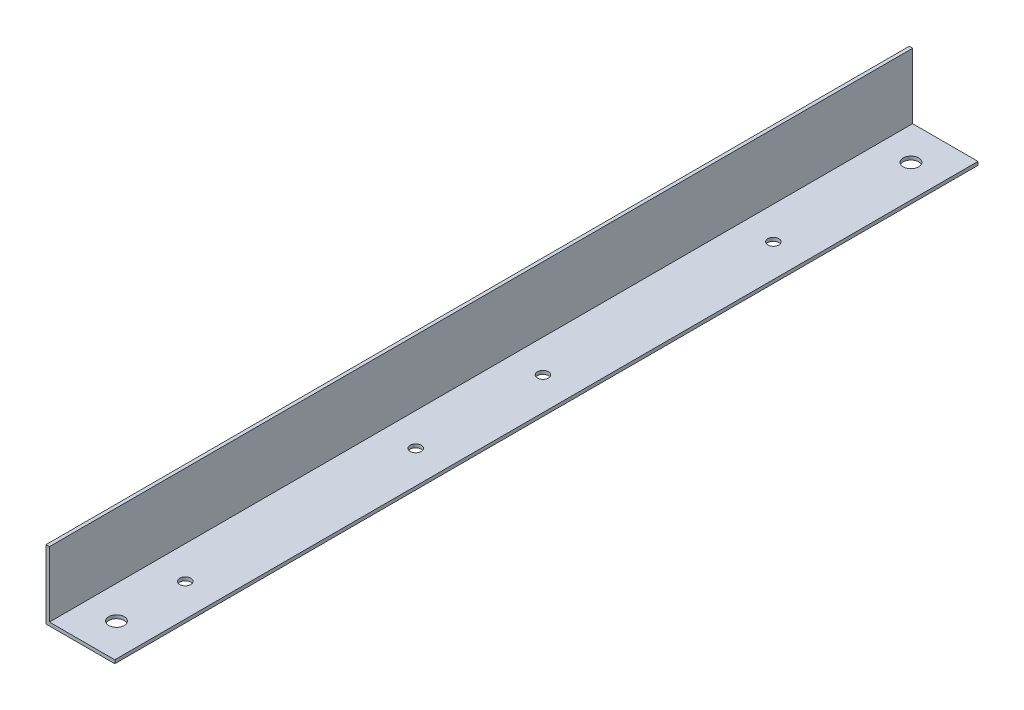
ISO-10303-21;
HEADER;
FILE_DESCRIPTION(('STEP AP214'),'2;1');
FILE_NAME('part.step','',(''),(''),'','','');
FILE_SCHEMA(('AUTOMOTIVE_DESIGN { 1 0 10303 214 1 1 1 1 }'));
ENDSEC;
DATA;
#1=APPLICATION_CONTEXT('core data for automotive mechanical design processes');
#2=APPLICATION_PROTOCOL_DEFINITION('international standard','automotive_design',2000,#1);
#3=PRODUCT_CONTEXT('',#1,'mechanical');
#4=PRODUCT('Part','Part','',(#3));
#5=PRODUCT_RELATED_PRODUCT_CATEGORY('part','',(#4));
#6=PRODUCT_DEFINITION_FORMATION('','',#4);
#7=PRODUCT_DEFINITION_CONTEXT('part definition',#1,'design');
#8=PRODUCT_DEFINITION('design','',#6,#7);
#9=PRODUCT_DEFINITION_SHAPE('','',#8);
#10=(LENGTH_UNIT() NAMED_UNIT(*) SI_UNIT(.MILLI.,.METRE.));
#11=(NAMED_UNIT(*) PLANE_ANGLE_UNIT() SI_UNIT($,.RADIAN.));
#12=(NAMED_UNIT(*) SI_UNIT($,.STERADIAN.) SOLID_ANGLE_UNIT());
#13=UNCERTAINTY_MEASURE_WITH_UNIT(LENGTH_MEASURE(1.E-05),#10,'distance_accuracy_value','');
#14=(GEOMETRIC_REPRESENTATION_CONTEXT(3) GLOBAL_UNCERTAINTY_ASSIGNED_CONTEXT((#13)) GLOBAL_UNIT_ASSIGNED_CONTEXT((#10,
#11,#12)) REPRESENTATION_CONTEXT('',''));
#15=CARTESIAN_POINT('',(0.,0.,0.));
#16=DIRECTION('',(0.,0.,1.));
#17=DIRECTION('',(1.,0.,0.));
#18=AXIS2_PLACEMENT_3D('',#15,#16,#17);
#19=CARTESIAN_POINT('',(20.,0.,251.));
#20=DIRECTION('',(0.,1.,0.));
#21=DIRECTION('',(-1.,0.,0.));
#22=AXIS2_PLACEMENT_3D('',#19,#20,#21);
#23=PLANE('',#22);
#24=CARTESIAN_POINT('',(10.5,0.,10.));
#25=DIRECTION('',(0.,1.,0.));
#26=DIRECTION('',(0.,0.,1.));
#27=AXIS2_PLACEMENT_3D('',#24,#25,#26);
#28=CIRCLE('',#27,2.25);
#29=CARTESIAN_POINT('',(10.5,0.,12.25));
#30=VERTEX_POINT('',#29);
#31=EDGE_CURVE('E166',#30,#30,#28,.T.);
#32=ORIENTED_EDGE('',*,*,#31,.T.);
#33=EDGE_LOOP('',(#32));
#34=FACE_BOUND('',#33,.T.);
#35=CARTESIAN_POINT('',(10.5,0.,241.));
#36=DIRECTION('',(0.,1.,0.));
#37=DIRECTION('',(0.,0.,1.));
#38=AXIS2_PLACEMENT_3D('',#35,#36,#37);
#39=CIRCLE('',#38,2.25);
#40=CARTESIAN_POINT('',(10.5,0.,243.25));
#41=VERTEX_POINT('',#40);
#42=EDGE_CURVE('E170',#41,#41,#39,.T.);
#43=ORIENTED_EDGE('',*,*,#42,.T.);
#44=EDGE_LOOP('',(#43));
#45=FACE_BOUND('',#44,.T.);
#46=CARTESIAN_POINT('',(10.5,0.,154.));
#47=DIRECTION('',(0.,1.,0.));
#48=DIRECTION('',(0.,0.,1.));
#49=AXIS2_PLACEMENT_3D('',#46,#47,#48);
#50=CIRCLE('',#49,1.6);
#51=CARTESIAN_POINT('',(10.5,0.,155.6));
#52=VERTEX_POINT('',#51);
#53=EDGE_CURVE('E174',#52,#52,#50,.T.);
#54=ORIENTED_EDGE('',*,*,#53,.T.);
#55=EDGE_LOOP('',(#54));
#56=FACE_BOUND('',#55,.T.);
#57=CARTESIAN_POINT('',(10.5,0.,221.));
#58=DIRECTION('',(0.,1.,0.));
#59=DIRECTION('',(0.,0.,1.));
#60=AXIS2_PLACEMENT_3D('',#57,#58,#59);
#61=CIRCLE('',#60,1.59999999999999);
#62=CARTESIAN_POINT('',(10.5,0.,222.6));
#63=VERTEX_POINT('',#62);
#64=EDGE_CURVE('E178',#63,#63,#61,.T.);
#65=ORIENTED_EDGE('',*,*,#64,.T.);
#66=EDGE_LOOP('',(#65));
#67=FACE_BOUND('',#66,.T.);
#68=CARTESIAN_POINT('',(10.5,0.,117.));
#69=DIRECTION('',(0.,1.,0.));
#70=DIRECTION('',(0.,0.,1.));
#71=AXIS2_PLACEMENT_3D('',#68,#69,#70);
#72=CIRCLE('',#71,1.6);
#73=CARTESIAN_POINT('',(10.5,0.,118.6));
#74=VERTEX_POINT('',#73);
#75=EDGE_CURVE('E182',#74,#74,#72,.T.);
#76=ORIENTED_EDGE('',*,*,#75,.T.);
#77=EDGE_LOOP('',(#76));
#78=FACE_BOUND('',#77,.T.);
#79=CARTESIAN_POINT('',(10.5,0.,50.));
#80=DIRECTION('',(0.,1.,0.));
#81=DIRECTION('',(0.,0.,1.));
#82=AXIS2_PLACEMENT_3D('',#79,#80,#81);
#83=CIRCLE('',#82,1.6);
#84=CARTESIAN_POINT('',(10.5,0.,51.6));
#85=VERTEX_POINT('',#84);
#86=EDGE_CURVE('E125',#85,#85,#83,.T.);
#87=ORIENTED_EDGE('',*,*,#86,.T.);
#88=EDGE_LOOP('',(#87));
#89=FACE_BOUND('',#88,.T.);
#90=DIRECTION('',(1.,0.,0.));
#91=VECTOR('',#90,1.);
#92=CARTESIAN_POINT('',(20.,0.,0.));
#93=LINE('',#92,#91);
#94=CARTESIAN_POINT('',(0.,0.,0.));
#95=VERTEX_POINT('',#94);
#96=CARTESIAN_POINT('',(20.,0.,0.));
#97=VERTEX_POINT('',#96);
#98=EDGE_CURVE('E121',#95,#97,#93,.T.);
#99=ORIENTED_EDGE('',*,*,#98,.T.);
#100=DIRECTION('',(0.,0.,-1.));
#101=VECTOR('',#100,1.);
#102=CARTESIAN_POINT('',(20.,0.,251.));
#103=LINE('',#102,#101);
#104=CARTESIAN_POINT('',(20.,0.,251.));
#105=VERTEX_POINT('',#104);
#106=EDGE_CURVE('E11',#105,#97,#103,.T.);
#107=ORIENTED_EDGE('',*,*,#106,.F.);
#108=DIRECTION('',(1.,0.,0.));
#109=VECTOR('',#108,1.);
#110=CARTESIAN_POINT('',(20.,0.,251.));
#111=LINE('',#110,#109);
#112=CARTESIAN_POINT('',(0.,0.,251.));
#113=VERTEX_POINT('',#112);
#114=EDGE_CURVE('E132',#113,#105,#111,.T.);
#115=ORIENTED_EDGE('',*,*,#114,.F.);
#116=DIRECTION('',(0.,0.,-1.));
#117=VECTOR('',#116,1.);
#118=CARTESIAN_POINT('',(0.,0.,251.));
#119=LINE('',#118,#117);
#120=EDGE_CURVE('E117',#113,#95,#119,.T.);
#121=ORIENTED_EDGE('',*,*,#120,.T.);
#122=EDGE_LOOP('',(#99,#107,#115,#121));
#123=FACE_BOUND('',#122,.T.);
#124=ADVANCED_FACE('F37',(#34,#45,#56,#67,#78,#89,#123),#23,.F.);
#125=CARTESIAN_POINT('',(20.,1.,251.));
#126=DIRECTION('',(-1.,0.,0.));
#127=DIRECTION('',(0.,0.,1.));
#128=AXIS2_PLACEMENT_3D('',#125,#126,#127);
#129=PLANE('',#128);
#130=DIRECTION('',(0.,1.,0.));
#131=VECTOR('',#130,1.);
#132=CARTESIAN_POINT('',(20.,1.,0.));
#133=LINE('',#132,#131);
#134=CARTESIAN_POINT('',(20.,1.,0.));
#135=VERTEX_POINT('',#134);
#136=EDGE_CURVE('E124',#97,#135,#133,.T.);
#137=ORIENTED_EDGE('',*,*,#136,.T.);
#138=DIRECTION('',(0.,0.,-1.));
#139=VECTOR('',#138,1.);
#140=CARTESIAN_POINT('',(20.,1.,251.));
#141=LINE('',#140,#139);
#142=CARTESIAN_POINT('',(20.,1.,251.));
#143=VERTEX_POINT('',#142);
#144=EDGE_CURVE('E45',#143,#135,#141,.T.);
#145=ORIENTED_EDGE('',*,*,#144,.F.);
#146=DIRECTION('',(0.,1.,0.));
#147=VECTOR('',#146,1.);
#148=CARTESIAN_POINT('',(20.,1.,251.));
#149=LINE('',#148,#147);
#150=EDGE_CURVE('E90',#105,#143,#149,.T.);
#151=ORIENTED_EDGE('',*,*,#150,.F.);
#152=ORIENTED_EDGE('',*,*,#106,.T.);
#153=EDGE_LOOP('',(#137,#145,#151,#152));
#154=FACE_BOUND('',#153,.T.);
#155=ADVANCED_FACE('F156',(#154),#129,.F.);
#156=CARTESIAN_POINT('',(1.,1.,251.));
#157=DIRECTION('',(0.,-1.,0.));
#158=DIRECTION('',(0.,0.,-1.));
#159=AXIS2_PLACEMENT_3D('',#156,#157,#158);
#160=PLANE('',#159);
#161=CARTESIAN_POINT('',(10.5,1.,10.));
#162=DIRECTION('',(0.,1.,0.));
#163=DIRECTION('',(0.,0.,1.));
#164=AXIS2_PLACEMENT_3D('',#161,#162,#163);
#165=CIRCLE('',#164,2.25);
#166=CARTESIAN_POINT('',(10.5,1.,12.25));
#167=VERTEX_POINT('',#166);
#168=EDGE_CURVE('E209',#167,#167,#165,.T.);
#169=ORIENTED_EDGE('',*,*,#168,.F.);
#170=EDGE_LOOP('',(#169));
#171=FACE_BOUND('',#170,.T.);
#172=CARTESIAN_POINT('',(10.5,1.,241.));
#173=DIRECTION('',(0.,1.,0.));
#174=DIRECTION('',(0.,0.,1.));
#175=AXIS2_PLACEMENT_3D('',#172,#173,#174);
#176=CIRCLE('',#175,2.25);
#177=CARTESIAN_POINT('',(10.5,1.,243.25));
#178=VERTEX_POINT('',#177);
#179=EDGE_CURVE('E205',#178,#178,#176,.T.);
#180=ORIENTED_EDGE('',*,*,#179,.F.);
#181=EDGE_LOOP('',(#180));
#182=FACE_BOUND('',#181,.T.);
#183=CARTESIAN_POINT('',(10.5,1.,154.));
#184=DIRECTION('',(0.,1.,0.));
#185=DIRECTION('',(0.,0.,1.));
#186=AXIS2_PLACEMENT_3D('',#183,#184,#185);
#187=CIRCLE('',#186,1.6);
#188=CARTESIAN_POINT('',(10.5,1.,155.6));
#189=VERTEX_POINT('',#188);
#190=EDGE_CURVE('E201',#189,#189,#187,.T.);
#191=ORIENTED_EDGE('',*,*,#190,.F.);
#192=EDGE_LOOP('',(#191));
#193=FACE_BOUND('',#192,.T.);
#194=CARTESIAN_POINT('',(10.5,1.,221.));
#195=DIRECTION('',(0.,1.,0.));
#196=DIRECTION('',(0.,0.,1.));
#197=AXIS2_PLACEMENT_3D('',#194,#195,#196);
#198=CIRCLE('',#197,1.59999999999999);
#199=CARTESIAN_POINT('',(10.5,1.,222.6));
#200=VERTEX_POINT('',#199);
#201=EDGE_CURVE('E197',#200,#200,#198,.T.);
#202=ORIENTED_EDGE('',*,*,#201,.F.);
#203=EDGE_LOOP('',(#202));
#204=FACE_BOUND('',#203,.T.);
#205=CARTESIAN_POINT('',(10.5,1.,117.));
#206=DIRECTION('',(0.,1.,0.));
#207=DIRECTION('',(0.,0.,1.));
#208=AXIS2_PLACEMENT_3D('',#205,#206,#207);
#209=CIRCLE('',#208,1.6);
#210=CARTESIAN_POINT('',(10.5,1.,118.6));
#211=VERTEX_POINT('',#210);
#212=EDGE_CURVE('E191',#211,#211,#209,.T.);
#213=ORIENTED_EDGE('',*,*,#212,.F.);
#214=EDGE_LOOP('',(#213));
#215=FACE_BOUND('',#214,.T.);
#216=CARTESIAN_POINT('',(10.5,1.,50.));
#217=DIRECTION('',(0.,1.,0.));
#218=DIRECTION('',(0.,0.,1.));
#219=AXIS2_PLACEMENT_3D('',#216,#217,#218);
#220=CIRCLE('',#219,1.6);
#221=CARTESIAN_POINT('',(10.5,1.,51.6));
#222=VERTEX_POINT('',#221);
#223=EDGE_CURVE('E186',#222,#222,#220,.T.);
#224=ORIENTED_EDGE('',*,*,#223,.F.);
#225=EDGE_LOOP('',(#224));
#226=FACE_BOUND('',#225,.T.);
#227=DIRECTION('',(-1.,0.,0.));
#228=VECTOR('',#227,1.);
#229=CARTESIAN_POINT('',(1.,1.,0.));
#230=LINE('',#229,#228);
#231=CARTESIAN_POINT('',(1.,1.,0.));
#232=VERTEX_POINT('',#231);
#233=EDGE_CURVE('E127',#135,#232,#230,.T.);
#234=ORIENTED_EDGE('',*,*,#233,.T.);
#235=DIRECTION('',(0.,0.,-1.));
#236=VECTOR('',#235,1.);
#237=CARTESIAN_POINT('',(1.,1.,251.));
#238=LINE('',#237,#236);
#239=CARTESIAN_POINT('',(1.,1.,251.));
#240=VERTEX_POINT('',#239);
#241=EDGE_CURVE('E112',#240,#232,#238,.T.);
#242=ORIENTED_EDGE('',*,*,#241,.F.);
#243=DIRECTION('',(-1.,0.,0.));
#244=VECTOR('',#243,1.);
#245=CARTESIAN_POINT('',(1.,1.,251.));
#246=LINE('',#245,#244);
#247=EDGE_CURVE('E103',#143,#240,#246,.T.);
#248=ORIENTED_EDGE('',*,*,#247,.F.);
#249=ORIENTED_EDGE('',*,*,#144,.T.);
#250=EDGE_LOOP('',(#234,#242,#248,#249));
#251=FACE_BOUND('',#250,.T.);
#252=ADVANCED_FACE('F138',(#171,#182,#193,#204,#215,#226,#251),#160,.F.);
#253=CARTESIAN_POINT('',(1.,20.,251.));
#254=DIRECTION('',(-1.,0.,0.));
#255=DIRECTION('',(0.,-1.,0.));
#256=AXIS2_PLACEMENT_3D('',#253,#254,#255);
#257=PLANE('',#256);
#258=DIRECTION('',(0.,1.,0.));
#259=VECTOR('',#258,1.);
#260=CARTESIAN_POINT('',(1.,20.,0.));
#261=LINE('',#260,#259);
#262=CARTESIAN_POINT('',(1.,20.,0.));
#263=VERTEX_POINT('',#262);
#264=EDGE_CURVE('E111',#232,#263,#261,.T.);
#265=ORIENTED_EDGE('',*,*,#264,.T.);
#266=DIRECTION('',(0.,0.,-1.));
#267=VECTOR('',#266,1.);
#268=CARTESIAN_POINT('',(1.,20.,251.));
#269=LINE('',#268,#267);
#270=CARTESIAN_POINT('',(1.,20.,251.));
#271=VERTEX_POINT('',#270);
#272=EDGE_CURVE('E108',#271,#263,#269,.T.);
#273=ORIENTED_EDGE('',*,*,#272,.F.);
#274=DIRECTION('',(0.,1.,0.));
#275=VECTOR('',#274,1.);
#276=CARTESIAN_POINT('',(1.,20.,251.));
#277=LINE('',#276,#275);
#278=EDGE_CURVE('E97',#240,#271,#277,.T.);
#279=ORIENTED_EDGE('',*,*,#278,.F.);
#280=ORIENTED_EDGE('',*,*,#241,.T.);
#281=EDGE_LOOP('',(#265,#273,#279,#280));
#282=FACE_BOUND('',#281,.T.);
#283=ADVANCED_FACE('F109',(#282),#257,.F.);
#284=CARTESIAN_POINT('',(0.,20.,251.));
#285=DIRECTION('',(0.,-1.,0.));
#286=DIRECTION('',(0.,0.,-1.));
#287=AXIS2_PLACEMENT_3D('',#284,#285,#286);
#288=PLANE('',#287);
#289=DIRECTION('',(-1.,0.,0.));
#290=VECTOR('',#289,1.);
#291=CARTESIAN_POINT('',(0.,20.,0.));
#292=LINE('',#291,#290);
#293=CARTESIAN_POINT('',(0.,20.,0.));
#294=VERTEX_POINT('',#293);
#295=EDGE_CURVE('E76',#263,#294,#292,.T.);
#296=ORIENTED_EDGE('',*,*,#295,.T.);
#297=DIRECTION('',(0.,0.,-1.));
#298=VECTOR('',#297,1.);
#299=CARTESIAN_POINT('',(0.,20.,251.));
#300=LINE('',#299,#298);
#301=CARTESIAN_POINT('',(0.,20.,251.));
#302=VERTEX_POINT('',#301);
#303=EDGE_CURVE('E113',#302,#294,#300,.T.);
#304=ORIENTED_EDGE('',*,*,#303,.F.);
#305=DIRECTION('',(-1.,0.,0.));
#306=VECTOR('',#305,1.);
#307=CARTESIAN_POINT('',(0.,20.,251.));
#308=LINE('',#307,#306);
#309=EDGE_CURVE('E101',#271,#302,#308,.T.);
#310=ORIENTED_EDGE('',*,*,#309,.F.);
#311=ORIENTED_EDGE('',*,*,#272,.T.);
#312=EDGE_LOOP('',(#296,#304,#310,#311));
#313=FACE_BOUND('',#312,.T.);
#314=ADVANCED_FACE('F115',(#313),#288,.F.);
#315=CARTESIAN_POINT('',(0.,0.,251.));
#316=DIRECTION('',(1.,0.,0.));
#317=DIRECTION('',(0.,0.,-1.));
#318=AXIS2_PLACEMENT_3D('',#315,#316,#317);
#319=PLANE('',#318);
#320=DIRECTION('',(0.,-1.,0.));
#321=VECTOR('',#320,1.);
#322=CARTESIAN_POINT('',(0.,0.,0.));
#323=LINE('',#322,#321);
#324=EDGE_CURVE('E82',#294,#95,#323,.T.);
#325=ORIENTED_EDGE('',*,*,#324,.T.);
#326=ORIENTED_EDGE('',*,*,#120,.F.);
#327=DIRECTION('',(0.,-1.,0.));
#328=VECTOR('',#327,1.);
#329=CARTESIAN_POINT('',(0.,0.,251.));
#330=LINE('',#329,#328);
#331=EDGE_CURVE('E53',#302,#113,#330,.T.);
#332=ORIENTED_EDGE('',*,*,#331,.F.);
#333=ORIENTED_EDGE('',*,*,#303,.T.);
#334=EDGE_LOOP('',(#325,#326,#332,#333));
#335=FACE_BOUND('',#334,.T.);
#336=ADVANCED_FACE('F145',(#335),#319,.F.);
#337=CARTESIAN_POINT('',(0.,0.,251.));
#338=DIRECTION('',(0.,0.,-1.));
#339=DIRECTION('',(-1.,0.,0.));
#340=AXIS2_PLACEMENT_3D('',#337,#338,#339);
#341=PLANE('',#340);
#342=ORIENTED_EDGE('',*,*,#114,.T.);
#343=ORIENTED_EDGE('',*,*,#150,.T.);
#344=ORIENTED_EDGE('',*,*,#247,.T.);
#345=ORIENTED_EDGE('',*,*,#278,.T.);
#346=ORIENTED_EDGE('',*,*,#309,.T.);
#347=ORIENTED_EDGE('',*,*,#331,.T.);
#348=EDGE_LOOP('',(#342,#343,#344,#345,#346,#347));
#349=FACE_BOUND('',#348,.T.);
#350=ADVANCED_FACE('F99',(#349),#341,.F.);
#351=CARTESIAN_POINT('',(0.,0.,0.));
#352=DIRECTION('',(0.,0.,-1.));
#353=DIRECTION('',(-1.,0.,0.));
#354=AXIS2_PLACEMENT_3D('',#351,#352,#353);
#355=PLANE('',#354);
#356=ORIENTED_EDGE('',*,*,#98,.F.);
#357=ORIENTED_EDGE('',*,*,#324,.F.);
#358=ORIENTED_EDGE('',*,*,#295,.F.);
#359=ORIENTED_EDGE('',*,*,#264,.F.);
#360=ORIENTED_EDGE('',*,*,#233,.F.);
#361=ORIENTED_EDGE('',*,*,#136,.F.);
#362=EDGE_LOOP('',(#356,#357,#358,#359,#360,#361));
#363=FACE_BOUND('',#362,.T.);
#364=ADVANCED_FACE('F141',(#363),#355,.T.);
#365=CARTESIAN_POINT('',(10.5,0.,50.));
#366=DIRECTION('',(0.,1.,0.));
#367=DIRECTION('',(0.,0.,1.));
#368=AXIS2_PLACEMENT_3D('',#365,#366,#367);
#369=CYLINDRICAL_SURFACE('',#368,1.6);
#370=ORIENTED_EDGE('',*,*,#86,.F.);
#371=EDGE_LOOP('',(#370));
#372=FACE_BOUND('',#371,.T.);
#373=ORIENTED_EDGE('',*,*,#223,.T.);
#374=EDGE_LOOP('',(#373));
#375=FACE_BOUND('',#374,.T.);
#376=ADVANCED_FACE('F228',(#372,#375),#369,.F.);
#377=CARTESIAN_POINT('',(10.5,0.,117.));
#378=DIRECTION('',(0.,1.,0.));
#379=DIRECTION('',(0.,0.,1.));
#380=AXIS2_PLACEMENT_3D('',#377,#378,#379);
#381=CYLINDRICAL_SURFACE('',#380,1.6);
#382=ORIENTED_EDGE('',*,*,#75,.F.);
#383=EDGE_LOOP('',(#382));
#384=FACE_BOUND('',#383,.T.);
#385=ORIENTED_EDGE('',*,*,#212,.T.);
#386=EDGE_LOOP('',(#385));
#387=FACE_BOUND('',#386,.T.);
#388=ADVANCED_FACE('F230',(#384,#387),#381,.F.);
#389=CARTESIAN_POINT('',(10.5,0.,221.));
#390=DIRECTION('',(0.,1.,0.));
#391=DIRECTION('',(0.,0.,1.));
#392=AXIS2_PLACEMENT_3D('',#389,#390,#391);
#393=CYLINDRICAL_SURFACE('',#392,1.59999999999999);
#394=ORIENTED_EDGE('',*,*,#64,.F.);
#395=EDGE_LOOP('',(#394));
#396=FACE_BOUND('',#395,.T.);
#397=ORIENTED_EDGE('',*,*,#201,.T.);
#398=EDGE_LOOP('',(#397));
#399=FACE_BOUND('',#398,.T.);
#400=ADVANCED_FACE('F236',(#396,#399),#393,.F.);
#401=CARTESIAN_POINT('',(10.5,0.,154.));
#402=DIRECTION('',(0.,1.,0.));
#403=DIRECTION('',(0.,0.,1.));
#404=AXIS2_PLACEMENT_3D('',#401,#402,#403);
#405=CYLINDRICAL_SURFACE('',#404,1.6);
#406=ORIENTED_EDGE('',*,*,#53,.F.);
#407=EDGE_LOOP('',(#406));
#408=FACE_BOUND('',#407,.T.);
#409=ORIENTED_EDGE('',*,*,#190,.T.);
#410=EDGE_LOOP('',(#409));
#411=FACE_BOUND('',#410,.T.);
#412=ADVANCED_FACE('F242',(#408,#411),#405,.F.);
#413=CARTESIAN_POINT('',(10.5,0.,241.));
#414=DIRECTION('',(0.,1.,0.));
#415=DIRECTION('',(0.,0.,1.));
#416=AXIS2_PLACEMENT_3D('',#413,#414,#415);
#417=CYLINDRICAL_SURFACE('',#416,2.25);
#418=ORIENTED_EDGE('',*,*,#42,.F.);
#419=EDGE_LOOP('',(#418));
#420=FACE_BOUND('',#419,.T.);
#421=ORIENTED_EDGE('',*,*,#179,.T.);
#422=EDGE_LOOP('',(#421));
#423=FACE_BOUND('',#422,.T.);
#424=ADVANCED_FACE('F246',(#420,#423),#417,.F.);
#425=CARTESIAN_POINT('',(10.5,0.,10.));
#426=DIRECTION('',(0.,1.,0.));
#427=DIRECTION('',(0.,0.,1.));
#428=AXIS2_PLACEMENT_3D('',#425,#426,#427);
#429=CYLINDRICAL_SURFACE('',#428,2.25);
#430=ORIENTED_EDGE('',*,*,#31,.F.);
#431=EDGE_LOOP('',(#430));
#432=FACE_BOUND('',#431,.T.);
#433=ORIENTED_EDGE('',*,*,#168,.T.);
#434=EDGE_LOOP('',(#433));
#435=FACE_BOUND('',#434,.T.);
#436=ADVANCED_FACE('F214',(#432,#435),#429,.F.);
#437=CLOSED_SHELL('',(#124,#155,#252,#283,#314,#336,#350,#364,#376,#388,#400,#412,#424,#436));
#438=MANIFOLD_SOLID_BREP('B2',#437);
#439=ADVANCED_BREP_SHAPE_REPRESENTATION('',(#18,#438),#14);
#440=SHAPE_DEFINITION_REPRESENTATION(#9,#439);
ENDSEC;
END-ISO-10303-21;
